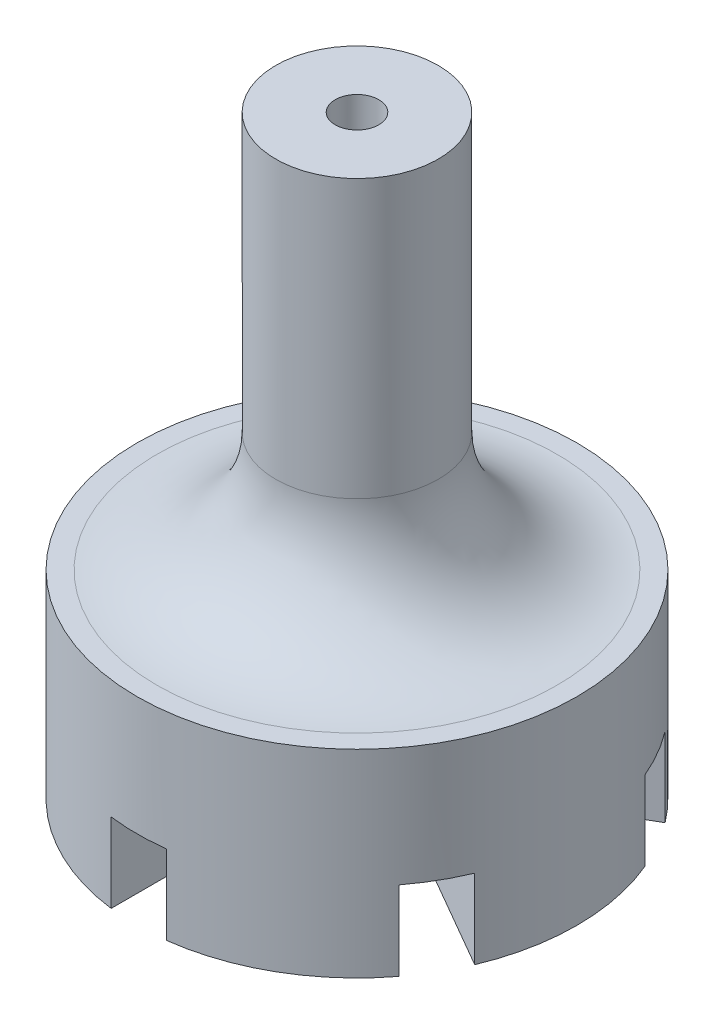
ISO-10303-21;
HEADER;
FILE_DESCRIPTION(('STEP AP214'),'2;1');
FILE_NAME('part.step','',(''),(''),'','','');
FILE_SCHEMA(('AUTOMOTIVE_DESIGN { 1 0 10303 214 1 1 1 1 }'));
ENDSEC;
DATA;
#1=APPLICATION_CONTEXT('core data for automotive mechanical design processes');
#2=APPLICATION_PROTOCOL_DEFINITION('international standard','automotive_design',2000,#1);
#3=PRODUCT_CONTEXT('',#1,'mechanical');
#4=PRODUCT('Part','Part','',(#3));
#5=PRODUCT_RELATED_PRODUCT_CATEGORY('part','',(#4));
#6=PRODUCT_DEFINITION_FORMATION('','',#4);
#7=PRODUCT_DEFINITION_CONTEXT('part definition',#1,'design');
#8=PRODUCT_DEFINITION('design','',#6,#7);
#9=PRODUCT_DEFINITION_SHAPE('','',#8);
#10=(LENGTH_UNIT() NAMED_UNIT(*) SI_UNIT(.MILLI.,.METRE.));
#11=(NAMED_UNIT(*) PLANE_ANGLE_UNIT() SI_UNIT($,.RADIAN.));
#12=(NAMED_UNIT(*) SI_UNIT($,.STERADIAN.) SOLID_ANGLE_UNIT());
#13=UNCERTAINTY_MEASURE_WITH_UNIT(LENGTH_MEASURE(1.E-05),#10,'distance_accuracy_value','');
#14=(GEOMETRIC_REPRESENTATION_CONTEXT(3) GLOBAL_UNCERTAINTY_ASSIGNED_CONTEXT((#13)) GLOBAL_UNIT_ASSIGNED_CONTEXT((#10,
#11,#12)) REPRESENTATION_CONTEXT('',''));
#15=CARTESIAN_POINT('',(0.,0.,0.));
#16=DIRECTION('',(0.,0.,1.));
#17=DIRECTION('',(1.,0.,0.));
#18=AXIS2_PLACEMENT_3D('',#15,#16,#17);
#19=CARTESIAN_POINT('',(0.,0.,0.));
#20=DIRECTION('',(0.,-1.,0.));
#21=DIRECTION('',(0.,0.,-1.));
#22=AXIS2_PLACEMENT_3D('',#19,#20,#21);
#23=CYLINDRICAL_SURFACE('',#22,0.55);
#24=CARTESIAN_POINT('',(0.,10.,0.));
#25=DIRECTION('',(0.,-1.,0.));
#26=DIRECTION('',(0.,0.,-1.));
#27=AXIS2_PLACEMENT_3D('',#24,#25,#26);
#28=CIRCLE('',#27,0.55);
#29=CARTESIAN_POINT('',(0.,10.,-0.55));
#30=VERTEX_POINT('',#29);
#31=EDGE_CURVE('E318',#30,#30,#28,.T.);
#32=ORIENTED_EDGE('',*,*,#31,.F.);
#33=EDGE_LOOP('',(#32));
#34=FACE_BOUND('',#33,.T.);
#35=CARTESIAN_POINT('',(0.,-3.,0.));
#36=DIRECTION('',(0.,-1.,0.));
#37=DIRECTION('',(0.,0.,-1.));
#38=AXIS2_PLACEMENT_3D('',#35,#36,#37);
#39=CIRCLE('',#38,0.55);
#40=CARTESIAN_POINT('',(0.,-3.,-0.55));
#41=VERTEX_POINT('',#40);
#42=EDGE_CURVE('E300',#41,#41,#39,.T.);
#43=ORIENTED_EDGE('',*,*,#42,.T.);
#44=EDGE_LOOP('',(#43));
#45=FACE_BOUND('',#44,.T.);
#46=ADVANCED_FACE('F43',(#34,#45),#23,.F.);
#47=CARTESIAN_POINT('',(5.55,-5.,0.));
#48=DIRECTION('',(0.,-1.,0.));
#49=DIRECTION('',(0.,0.,-1.));
#50=AXIS2_PLACEMENT_3D('',#47,#48,#49);
#51=PLANE('',#50);
#52=DIRECTION('',(0.,0.,1.));
#53=VECTOR('',#52,1.);
#54=CARTESIAN_POINT('',(0.7,-5.,1.21243556529821));
#55=LINE('',#54,#53);
#56=CARTESIAN_POINT('',(0.7,-5.,1.21243556529821));
#57=VERTEX_POINT('',#56);
#58=CARTESIAN_POINT('',(0.7,-5.,5.50567888638631));
#59=VERTEX_POINT('',#58);
#60=EDGE_CURVE('E179',#57,#59,#55,.T.);
#61=ORIENTED_EDGE('',*,*,#60,.F.);
#62=DIRECTION('',(-0.866025403784439,0.,-0.5));
#63=VECTOR('',#62,1.);
#64=CARTESIAN_POINT('',(3.8125,-5.,3.00943827815092));
#65=LINE('',#64,#63);
#66=CARTESIAN_POINT('',(4.41805778069016,-5.,3.35905722584226));
#67=VERTEX_POINT('',#66);
#68=EDGE_CURVE('E336',#67,#57,#65,.T.);
#69=ORIENTED_EDGE('',*,*,#68,.F.);
#70=CARTESIAN_POINT('',(0.,-5.,0.));
#71=DIRECTION('',(0.,-1.,0.));
#72=DIRECTION('',(0.,0.,-1.));
#73=AXIS2_PLACEMENT_3D('',#70,#71,#72);
#74=CIRCLE('',#73,5.55);
#75=EDGE_CURVE('E387',#67,#59,#74,.T.);
#76=ORIENTED_EDGE('',*,*,#75,.T.);
#77=EDGE_LOOP('',(#61,#69,#76));
#78=FACE_BOUND('',#77,.T.);
#79=ADVANCED_FACE('F424',(#78),#51,.T.);
#80=DIRECTION('',(0.866025403784439,0.,0.5));
#81=VECTOR('',#80,1.);
#82=CARTESIAN_POINT('',(1.4,-5.,0.));
#83=LINE('',#82,#81);
#84=CARTESIAN_POINT('',(1.4,-5.,0.));
#85=VERTEX_POINT('',#84);
#86=CARTESIAN_POINT('',(5.11805778069016,-5.,2.14662166054405));
#87=VERTEX_POINT('',#86);
#88=EDGE_CURVE('E242',#85,#87,#83,.T.);
#89=ORIENTED_EDGE('',*,*,#88,.F.);
#90=DIRECTION('',(-0.866025403784439,0.,0.5));
#91=VECTOR('',#90,1.);
#92=CARTESIAN_POINT('',(4.5125,-5.,-1.79700271285271));
#93=LINE('',#92,#91);
#94=CARTESIAN_POINT('',(5.11805778069016,-5.,-2.14662166054405));
#95=VERTEX_POINT('',#94);
#96=EDGE_CURVE('E333',#95,#85,#93,.T.);
#97=ORIENTED_EDGE('',*,*,#96,.F.);
#98=EDGE_CURVE('E391',#95,#87,#74,.T.);
#99=ORIENTED_EDGE('',*,*,#98,.T.);
#100=EDGE_LOOP('',(#89,#97,#99));
#101=FACE_BOUND('',#100,.T.);
#102=ADVANCED_FACE('F430',(#101),#51,.T.);
#103=DIRECTION('',(0.866025403784439,0.,-0.5));
#104=VECTOR('',#103,1.);
#105=CARTESIAN_POINT('',(0.7,-5.,-1.21243556529821));
#106=LINE('',#105,#104);
#107=CARTESIAN_POINT('',(0.7,-5.,-1.21243556529821));
#108=VERTEX_POINT('',#107);
#109=CARTESIAN_POINT('',(4.41805778069017,-5.,-3.35905722584226));
#110=VERTEX_POINT('',#109);
#111=EDGE_CURVE('E239',#108,#110,#106,.T.);
#112=ORIENTED_EDGE('',*,*,#111,.F.);
#113=DIRECTION('',(0.,0.,1.));
#114=VECTOR('',#113,1.);
#115=CARTESIAN_POINT('',(0.7,-5.,0.));
#116=LINE('',#115,#114);
#117=CARTESIAN_POINT('',(0.700000000000001,-5.,-5.50567888638631));
#118=VERTEX_POINT('',#117);
#119=EDGE_CURVE('E330',#118,#108,#116,.T.);
#120=ORIENTED_EDGE('',*,*,#119,.F.);
#121=EDGE_CURVE('E309',#118,#110,#74,.T.);
#122=ORIENTED_EDGE('',*,*,#121,.T.);
#123=EDGE_LOOP('',(#112,#120,#122));
#124=FACE_BOUND('',#123,.T.);
#125=ADVANCED_FACE('F501',(#124),#51,.T.);
#126=DIRECTION('',(0.,0.,-1.));
#127=VECTOR('',#126,1.);
#128=CARTESIAN_POINT('',(-0.7,-5.,-1.21243556529821));
#129=LINE('',#128,#127);
#130=CARTESIAN_POINT('',(-0.7,-5.,-1.21243556529821));
#131=VERTEX_POINT('',#130);
#132=CARTESIAN_POINT('',(-0.699999999999999,-5.,-5.50567888638631));
#133=VERTEX_POINT('',#132);
#134=EDGE_CURVE('E236',#131,#133,#129,.T.);
#135=ORIENTED_EDGE('',*,*,#134,.F.);
#136=DIRECTION('',(0.866025403784438,0.,0.500000000000001));
#137=VECTOR('',#136,1.);
#138=CARTESIAN_POINT('',(4.5125,-5.,1.79700271285271));
#139=LINE('',#138,#137);
#140=CARTESIAN_POINT('',(-4.41805778069016,-5.,-3.35905722584226));
#141=VERTEX_POINT('',#140);
#142=EDGE_CURVE('E327',#141,#131,#139,.T.);
#143=ORIENTED_EDGE('',*,*,#142,.F.);
#144=EDGE_CURVE('E304',#141,#133,#74,.T.);
#145=ORIENTED_EDGE('',*,*,#144,.T.);
#146=EDGE_LOOP('',(#135,#143,#145));
#147=FACE_BOUND('',#146,.T.);
#148=ADVANCED_FACE('F491',(#147),#51,.T.);
#149=DIRECTION('',(-0.866025403784438,0.,-0.5));
#150=VECTOR('',#149,1.);
#151=CARTESIAN_POINT('',(-1.4,-5.,0.));
#152=LINE('',#151,#150);
#153=CARTESIAN_POINT('',(-1.4,-5.,0.));
#154=VERTEX_POINT('',#153);
#155=CARTESIAN_POINT('',(-5.11805778069016,-5.,-2.14662166054405));
#156=VERTEX_POINT('',#155);
#157=EDGE_CURVE('E233',#154,#156,#152,.T.);
#158=ORIENTED_EDGE('',*,*,#157,.F.);
#159=DIRECTION('',(0.866025403784439,0.,-0.499999999999999));
#160=VECTOR('',#159,1.);
#161=CARTESIAN_POINT('',(3.81250000000001,-5.,-3.00943827815092));
#162=LINE('',#161,#160);
#163=CARTESIAN_POINT('',(-5.11805778069017,-5.,2.14662166054404));
#164=VERTEX_POINT('',#163);
#165=EDGE_CURVE('E324',#164,#154,#162,.T.);
#166=ORIENTED_EDGE('',*,*,#165,.F.);
#167=EDGE_CURVE('E308',#164,#156,#74,.T.);
#168=ORIENTED_EDGE('',*,*,#167,.T.);
#169=EDGE_LOOP('',(#158,#166,#168));
#170=FACE_BOUND('',#169,.T.);
#171=ADVANCED_FACE('F405',(#170),#51,.T.);
#172=CARTESIAN_POINT('',(0.55,10.,0.));
#173=DIRECTION('',(0.,1.,0.));
#174=DIRECTION('',(0.,0.,1.));
#175=AXIS2_PLACEMENT_3D('',#172,#173,#174);
#176=PLANE('',#175);
#177=ORIENTED_EDGE('',*,*,#31,.T.);
#178=EDGE_LOOP('',(#177));
#179=FACE_BOUND('',#178,.T.);
#180=CARTESIAN_POINT('',(0.,10.,0.));
#181=DIRECTION('',(0.,-1.,0.));
#182=DIRECTION('',(0.,0.,-1.));
#183=AXIS2_PLACEMENT_3D('',#180,#181,#182);
#184=CIRCLE('',#183,2.05);
#185=CARTESIAN_POINT('',(0.,10.,-2.05));
#186=VERTEX_POINT('',#185);
#187=EDGE_CURVE('E314',#186,#186,#184,.T.);
#188=ORIENTED_EDGE('',*,*,#187,.F.);
#189=EDGE_LOOP('',(#188));
#190=FACE_BOUND('',#189,.T.);
#191=ADVANCED_FACE('F436',(#179,#190),#176,.T.);
#192=CARTESIAN_POINT('',(0.,0.,0.));
#193=DIRECTION('',(0.,-1.,0.));
#194=DIRECTION('',(0.,0.,-1.));
#195=AXIS2_PLACEMENT_3D('',#192,#193,#194);
#196=CYLINDRICAL_SURFACE('',#195,2.05);
#197=CARTESIAN_POINT('',(0.,3.,0.));
#198=DIRECTION('',(0.,1.,0.));
#199=DIRECTION('',(0.,0.,1.));
#200=AXIS2_PLACEMENT_3D('',#197,#198,#199);
#201=CIRCLE('',#200,2.05);
#202=CARTESIAN_POINT('',(0.,3.,2.05));
#203=VERTEX_POINT('',#202);
#204=EDGE_CURVE('E11',#203,#203,#201,.T.);
#205=ORIENTED_EDGE('',*,*,#204,.T.);
#206=EDGE_LOOP('',(#205));
#207=FACE_BOUND('',#206,.T.);
#208=ORIENTED_EDGE('',*,*,#187,.T.);
#209=EDGE_LOOP('',(#208));
#210=FACE_BOUND('',#209,.T.);
#211=ADVANCED_FACE('F438',(#207,#210),#196,.T.);
#212=CARTESIAN_POINT('',(2.05,0.,0.));
#213=DIRECTION('',(0.,1.,0.));
#214=DIRECTION('',(0.,0.,1.));
#215=AXIS2_PLACEMENT_3D('',#212,#213,#214);
#216=PLANE('',#215);
#217=CARTESIAN_POINT('',(0.,0.,0.));
#218=DIRECTION('',(0.,1.,0.));
#219=DIRECTION('',(0.,0.,1.));
#220=AXIS2_PLACEMENT_3D('',#217,#218,#219);
#221=CIRCLE('',#220,5.05);
#222=CARTESIAN_POINT('',(0.,0.,5.05));
#223=VERTEX_POINT('',#222);
#224=EDGE_CURVE('E52',#223,#223,#221,.F.);
#225=ORIENTED_EDGE('',*,*,#224,.T.);
#226=EDGE_LOOP('',(#225));
#227=FACE_BOUND('',#226,.T.);
#228=CARTESIAN_POINT('',(0.,0.,0.));
#229=DIRECTION('',(0.,-1.,0.));
#230=DIRECTION('',(0.,0.,-1.));
#231=AXIS2_PLACEMENT_3D('',#228,#229,#230);
#232=CIRCLE('',#231,5.55);
#233=CARTESIAN_POINT('',(0.,0.,-5.55));
#234=VERTEX_POINT('',#233);
#235=EDGE_CURVE('E310',#234,#234,#232,.T.);
#236=ORIENTED_EDGE('',*,*,#235,.F.);
#237=EDGE_LOOP('',(#236));
#238=FACE_BOUND('',#237,.T.);
#239=ADVANCED_FACE('F442',(#227,#238),#216,.T.);
#240=CARTESIAN_POINT('',(0.,0.,0.));
#241=DIRECTION('',(0.,-1.,0.));
#242=DIRECTION('',(0.,0.,-1.));
#243=AXIS2_PLACEMENT_3D('',#240,#241,#242);
#244=CYLINDRICAL_SURFACE('',#243,5.55);
#245=DIRECTION('',(0.,-1.,0.));
#246=VECTOR('',#245,1.);
#247=CARTESIAN_POINT('',(-4.41805778069016,0.,-3.35905722584226));
#248=LINE('',#247,#246);
#249=CARTESIAN_POINT('',(-4.41805778069016,-3.,-3.35905722584226));
#250=VERTEX_POINT('',#249);
#251=EDGE_CURVE('E276',#250,#141,#248,.T.);
#252=ORIENTED_EDGE('',*,*,#251,.F.);
#253=CARTESIAN_POINT('',(0.,-3.,0.));
#254=DIRECTION('',(0.,-1.,0.));
#255=DIRECTION('',(0.,0.,-1.));
#256=AXIS2_PLACEMENT_3D('',#253,#254,#255);
#257=CIRCLE('',#256,5.55);
#258=CARTESIAN_POINT('',(-5.11805778069016,-3.,-2.14662166054405));
#259=VERTEX_POINT('',#258);
#260=EDGE_CURVE('E342',#250,#259,#257,.F.);
#261=ORIENTED_EDGE('',*,*,#260,.T.);
#262=DIRECTION('',(0.,-1.,0.));
#263=VECTOR('',#262,1.);
#264=CARTESIAN_POINT('',(-5.11805778069016,0.,-2.14662166054405));
#265=LINE('',#264,#263);
#266=EDGE_CURVE('E273',#156,#259,#265,.F.);
#267=ORIENTED_EDGE('',*,*,#266,.F.);
#268=ORIENTED_EDGE('',*,*,#167,.F.);
#269=DIRECTION('',(0.,-1.,0.));
#270=VECTOR('',#269,1.);
#271=CARTESIAN_POINT('',(-5.11805778069016,0.,2.14662166054404));
#272=LINE('',#271,#270);
#273=CARTESIAN_POINT('',(-5.11805778069016,-3.,2.14662166054404));
#274=VERTEX_POINT('',#273);
#275=EDGE_CURVE('E270',#274,#164,#272,.T.);
#276=ORIENTED_EDGE('',*,*,#275,.F.);
#277=CARTESIAN_POINT('',(-4.41805778069016,-3.,3.35905722584226));
#278=VERTEX_POINT('',#277);
#279=EDGE_CURVE('E349',#274,#278,#257,.F.);
#280=ORIENTED_EDGE('',*,*,#279,.T.);
#281=DIRECTION('',(0.,-1.,0.));
#282=VECTOR('',#281,1.);
#283=CARTESIAN_POINT('',(-4.41805778069017,0.,3.35905722584226));
#284=LINE('',#283,#282);
#285=CARTESIAN_POINT('',(-4.41805778069017,-5.,3.35905722584226));
#286=VERTEX_POINT('',#285);
#287=EDGE_CURVE('E193',#286,#278,#284,.F.);
#288=ORIENTED_EDGE('',*,*,#287,.F.);
#289=CARTESIAN_POINT('',(-0.7,-5.,5.50567888638631));
#290=VERTEX_POINT('',#289);
#291=EDGE_CURVE('E392',#290,#286,#74,.T.);
#292=ORIENTED_EDGE('',*,*,#291,.F.);
#293=DIRECTION('',(0.,-1.,0.));
#294=VECTOR('',#293,1.);
#295=CARTESIAN_POINT('',(-0.7,0.,5.50567888638631));
#296=LINE('',#295,#294);
#297=CARTESIAN_POINT('',(-0.7,-3.,5.50567888638631));
#298=VERTEX_POINT('',#297);
#299=EDGE_CURVE('E59',#298,#290,#296,.T.);
#300=ORIENTED_EDGE('',*,*,#299,.F.);
#301=CARTESIAN_POINT('',(0.7,-3.,5.50567888638631));
#302=VERTEX_POINT('',#301);
#303=EDGE_CURVE('E177',#298,#302,#257,.F.);
#304=ORIENTED_EDGE('',*,*,#303,.T.);
#305=DIRECTION('',(0.,-1.,0.));
#306=VECTOR('',#305,1.);
#307=CARTESIAN_POINT('',(0.7,0.,5.50567888638631));
#308=LINE('',#307,#306);
#309=EDGE_CURVE('E67',#59,#302,#308,.F.);
#310=ORIENTED_EDGE('',*,*,#309,.F.);
#311=ORIENTED_EDGE('',*,*,#75,.F.);
#312=DIRECTION('',(0.,-1.,0.));
#313=VECTOR('',#312,1.);
#314=CARTESIAN_POINT('',(4.41805778069016,0.,3.35905722584226));
#315=LINE('',#314,#313);
#316=CARTESIAN_POINT('',(4.41805778069016,-3.,3.35905722584226));
#317=VERTEX_POINT('',#316);
#318=EDGE_CURVE('E295',#317,#67,#315,.T.);
#319=ORIENTED_EDGE('',*,*,#318,.F.);
#320=CARTESIAN_POINT('',(5.11805778069016,-3.,2.14662166054405));
#321=VERTEX_POINT('',#320);
#322=EDGE_CURVE('E356',#317,#321,#257,.F.);
#323=ORIENTED_EDGE('',*,*,#322,.T.);
#324=DIRECTION('',(0.,-1.,0.));
#325=VECTOR('',#324,1.);
#326=CARTESIAN_POINT('',(5.11805778069016,0.,2.14662166054405));
#327=LINE('',#326,#325);
#328=EDGE_CURVE('E292',#87,#321,#327,.F.);
#329=ORIENTED_EDGE('',*,*,#328,.F.);
#330=ORIENTED_EDGE('',*,*,#98,.F.);
#331=DIRECTION('',(0.,-1.,0.));
#332=VECTOR('',#331,1.);
#333=CARTESIAN_POINT('',(5.11805778069016,0.,-2.14662166054405));
#334=LINE('',#333,#332);
#335=CARTESIAN_POINT('',(5.11805778069016,-3.,-2.14662166054405));
#336=VERTEX_POINT('',#335);
#337=EDGE_CURVE('E289',#336,#95,#334,.T.);
#338=ORIENTED_EDGE('',*,*,#337,.F.);
#339=CARTESIAN_POINT('',(4.41805778069016,-3.,-3.35905722584226));
#340=VERTEX_POINT('',#339);
#341=EDGE_CURVE('E341',#336,#340,#257,.F.);
#342=ORIENTED_EDGE('',*,*,#341,.T.);
#343=DIRECTION('',(0.,-1.,0.));
#344=VECTOR('',#343,1.);
#345=CARTESIAN_POINT('',(4.41805778069016,0.,-3.35905722584226));
#346=LINE('',#345,#344);
#347=EDGE_CURVE('E286',#110,#340,#346,.F.);
#348=ORIENTED_EDGE('',*,*,#347,.F.);
#349=ORIENTED_EDGE('',*,*,#121,.F.);
#350=DIRECTION('',(0.,-1.,0.));
#351=VECTOR('',#350,1.);
#352=CARTESIAN_POINT('',(0.700000000000001,0.,-5.50567888638631));
#353=LINE('',#352,#351);
#354=CARTESIAN_POINT('',(0.700000000000001,-3.,-5.50567888638631));
#355=VERTEX_POINT('',#354);
#356=EDGE_CURVE('E283',#355,#118,#353,.T.);
#357=ORIENTED_EDGE('',*,*,#356,.F.);
#358=CARTESIAN_POINT('',(-0.699999999999999,-3.,-5.50567888638631));
#359=VERTEX_POINT('',#358);
#360=EDGE_CURVE('E339',#355,#359,#257,.F.);
#361=ORIENTED_EDGE('',*,*,#360,.T.);
#362=DIRECTION('',(0.,-1.,0.));
#363=VECTOR('',#362,1.);
#364=CARTESIAN_POINT('',(-0.699999999999999,0.,-5.50567888638631));
#365=LINE('',#364,#363);
#366=EDGE_CURVE('E279',#133,#359,#365,.F.);
#367=ORIENTED_EDGE('',*,*,#366,.F.);
#368=ORIENTED_EDGE('',*,*,#144,.F.);
#369=EDGE_LOOP('',(#252,#261,#267,#268,#276,#280,#288,#292,#300,#304,#310,#311,#319,#323,#329,
#330,#338,#342,#348,#349,#357,#361,#367,#368));
#370=FACE_BOUND('',#369,.T.);
#371=ORIENTED_EDGE('',*,*,#235,.T.);
#372=EDGE_LOOP('',(#371));
#373=FACE_BOUND('',#372,.T.);
#374=ADVANCED_FACE('F365',(#370,#373),#244,.T.);
#375=DIRECTION('',(-0.866025403784439,0.,0.499999999999999));
#376=VECTOR('',#375,1.);
#377=CARTESIAN_POINT('',(-0.699999999999999,-5.,1.21243556529821));
#378=LINE('',#377,#376);
#379=CARTESIAN_POINT('',(-0.699999999999999,-5.,1.21243556529821));
#380=VERTEX_POINT('',#379);
#381=EDGE_CURVE('E230',#380,#286,#378,.T.);
#382=ORIENTED_EDGE('',*,*,#381,.F.);
#383=DIRECTION('',(0.,0.,-1.));
#384=VECTOR('',#383,1.);
#385=CARTESIAN_POINT('',(-0.699999999999999,-5.,0.));
#386=LINE('',#385,#384);
#387=EDGE_CURVE('E184',#290,#380,#386,.T.);
#388=ORIENTED_EDGE('',*,*,#387,.F.);
#389=ORIENTED_EDGE('',*,*,#291,.T.);
#390=EDGE_LOOP('',(#382,#388,#389));
#391=FACE_BOUND('',#390,.T.);
#392=ADVANCED_FACE('F432',(#391),#51,.T.);
#393=CARTESIAN_POINT('',(0.7,-3.,1.21243556529821));
#394=DIRECTION('',(1.,0.,0.));
#395=DIRECTION('',(0.,0.,-1.));
#396=AXIS2_PLACEMENT_3D('',#393,#394,#395);
#397=PLANE('',#396);
#398=ORIENTED_EDGE('',*,*,#309,.T.);
#399=DIRECTION('',(0.,0.,1.));
#400=VECTOR('',#399,1.);
#401=CARTESIAN_POINT('',(0.7,-3.,1.21243556529821));
#402=LINE('',#401,#400);
#403=CARTESIAN_POINT('',(0.7,-3.,1.21243556529821));
#404=VERTEX_POINT('',#403);
#405=EDGE_CURVE('E189',#404,#302,#402,.T.);
#406=ORIENTED_EDGE('',*,*,#405,.F.);
#407=DIRECTION('',(0.,-1.,0.));
#408=VECTOR('',#407,1.);
#409=CARTESIAN_POINT('',(0.7,-3.,1.21243556529821));
#410=LINE('',#409,#408);
#411=EDGE_CURVE('E247',#404,#57,#410,.T.);
#412=ORIENTED_EDGE('',*,*,#411,.T.);
#413=ORIENTED_EDGE('',*,*,#60,.T.);
#414=EDGE_LOOP('',(#398,#406,#412,#413));
#415=FACE_BOUND('',#414,.T.);
#416=ADVANCED_FACE('F449',(#415),#397,.F.);
#417=CARTESIAN_POINT('',(4.45644099100364,-3.,3.38121778264911));
#418=DIRECTION('',(-0.5,0.,0.866025403784439));
#419=DIRECTION('',(0.866025403784439,0.,0.5));
#420=AXIS2_PLACEMENT_3D('',#417,#418,#419);
#421=PLANE('',#420);
#422=ORIENTED_EDGE('',*,*,#318,.T.);
#423=ORIENTED_EDGE('',*,*,#68,.T.);
#424=ORIENTED_EDGE('',*,*,#411,.F.);
#425=DIRECTION('',(-0.866025403784439,0.,-0.5));
#426=VECTOR('',#425,1.);
#427=CARTESIAN_POINT('',(4.45644099100364,-3.,3.38121778264911));
#428=LINE('',#427,#426);
#429=EDGE_CURVE('E225',#317,#404,#428,.T.);
#430=ORIENTED_EDGE('',*,*,#429,.F.);
#431=EDGE_LOOP('',(#422,#423,#424,#430));
#432=FACE_BOUND('',#431,.T.);
#433=ADVANCED_FACE('F383',(#432),#421,.F.);
#434=CARTESIAN_POINT('',(1.4,-3.,0.));
#435=DIRECTION('',(0.5,0.,-0.866025403784439));
#436=DIRECTION('',(-0.866025403784439,0.,-0.5));
#437=AXIS2_PLACEMENT_3D('',#434,#435,#436);
#438=PLANE('',#437);
#439=ORIENTED_EDGE('',*,*,#328,.T.);
#440=DIRECTION('',(0.866025403784439,0.,0.5));
#441=VECTOR('',#440,1.);
#442=CARTESIAN_POINT('',(1.4,-3.,0.));
#443=LINE('',#442,#441);
#444=CARTESIAN_POINT('',(1.4,-3.,0.));
#445=VERTEX_POINT('',#444);
#446=EDGE_CURVE('E221',#445,#321,#443,.T.);
#447=ORIENTED_EDGE('',*,*,#446,.F.);
#448=DIRECTION('',(0.,-1.,0.));
#449=VECTOR('',#448,1.);
#450=CARTESIAN_POINT('',(1.4,-3.,0.));
#451=LINE('',#450,#449);
#452=EDGE_CURVE('E251',#445,#85,#451,.T.);
#453=ORIENTED_EDGE('',*,*,#452,.T.);
#454=ORIENTED_EDGE('',*,*,#88,.T.);
#455=EDGE_LOOP('',(#439,#447,#453,#454));
#456=FACE_BOUND('',#455,.T.);
#457=ADVANCED_FACE('F379',(#456),#438,.F.);
#458=CARTESIAN_POINT('',(5.15644099100363,-3.,-2.16878221735089));
#459=DIRECTION('',(0.5,0.,0.866025403784439));
#460=DIRECTION('',(0.866025403784439,0.,-0.5));
#461=AXIS2_PLACEMENT_3D('',#458,#459,#460);
#462=PLANE('',#461);
#463=ORIENTED_EDGE('',*,*,#337,.T.);
#464=ORIENTED_EDGE('',*,*,#96,.T.);
#465=ORIENTED_EDGE('',*,*,#452,.F.);
#466=DIRECTION('',(-0.866025403784439,0.,0.5));
#467=VECTOR('',#466,1.);
#468=CARTESIAN_POINT('',(5.15644099100363,-3.,-2.16878221735089));
#469=LINE('',#468,#467);
#470=EDGE_CURVE('E218',#336,#445,#469,.T.);
#471=ORIENTED_EDGE('',*,*,#470,.F.);
#472=EDGE_LOOP('',(#463,#464,#465,#471));
#473=FACE_BOUND('',#472,.T.);
#474=ADVANCED_FACE('F374',(#473),#462,.F.);
#475=CARTESIAN_POINT('',(0.7,-3.,-1.21243556529821));
#476=DIRECTION('',(-0.5,0.,-0.866025403784439));
#477=DIRECTION('',(-0.866025403784439,0.,0.5));
#478=AXIS2_PLACEMENT_3D('',#475,#476,#477);
#479=PLANE('',#478);
#480=ORIENTED_EDGE('',*,*,#347,.T.);
#481=DIRECTION('',(0.866025403784439,0.,-0.5));
#482=VECTOR('',#481,1.);
#483=CARTESIAN_POINT('',(0.7,-3.,-1.21243556529821));
#484=LINE('',#483,#482);
#485=CARTESIAN_POINT('',(0.7,-3.,-1.21243556529821));
#486=VERTEX_POINT('',#485);
#487=EDGE_CURVE('E214',#486,#340,#484,.T.);
#488=ORIENTED_EDGE('',*,*,#487,.F.);
#489=DIRECTION('',(0.,-1.,0.));
#490=VECTOR('',#489,1.);
#491=CARTESIAN_POINT('',(0.7,-3.,-1.21243556529821));
#492=LINE('',#491,#490);
#493=EDGE_CURVE('E255',#486,#108,#492,.T.);
#494=ORIENTED_EDGE('',*,*,#493,.T.);
#495=ORIENTED_EDGE('',*,*,#111,.T.);
#496=EDGE_LOOP('',(#480,#488,#494,#495));
#497=FACE_BOUND('',#496,.T.);
#498=ADVANCED_FACE('F470',(#497),#479,.F.);
#499=CARTESIAN_POINT('',(0.700000000000001,-3.,-5.55));
#500=DIRECTION('',(1.,0.,0.));
#501=DIRECTION('',(0.,0.,-1.));
#502=AXIS2_PLACEMENT_3D('',#499,#500,#501);
#503=PLANE('',#502);
#504=ORIENTED_EDGE('',*,*,#356,.T.);
#505=ORIENTED_EDGE('',*,*,#119,.T.);
#506=ORIENTED_EDGE('',*,*,#493,.F.);
#507=DIRECTION('',(0.,0.,1.));
#508=VECTOR('',#507,1.);
#509=CARTESIAN_POINT('',(0.700000000000001,-3.,-5.55));
#510=LINE('',#509,#508);
#511=EDGE_CURVE('E211',#355,#486,#510,.T.);
#512=ORIENTED_EDGE('',*,*,#511,.F.);
#513=EDGE_LOOP('',(#504,#505,#506,#512));
#514=FACE_BOUND('',#513,.T.);
#515=ADVANCED_FACE('F473',(#514),#503,.F.);
#516=CARTESIAN_POINT('',(-0.7,-3.,-1.21243556529821));
#517=DIRECTION('',(-1.,0.,0.));
#518=DIRECTION('',(0.,0.,1.));
#519=AXIS2_PLACEMENT_3D('',#516,#517,#518);
#520=PLANE('',#519);
#521=ORIENTED_EDGE('',*,*,#366,.T.);
#522=DIRECTION('',(0.,0.,-1.));
#523=VECTOR('',#522,1.);
#524=CARTESIAN_POINT('',(-0.7,-3.,-1.21243556529821));
#525=LINE('',#524,#523);
#526=CARTESIAN_POINT('',(-0.7,-3.,-1.21243556529821));
#527=VERTEX_POINT('',#526);
#528=EDGE_CURVE('E207',#527,#359,#525,.T.);
#529=ORIENTED_EDGE('',*,*,#528,.F.);
#530=DIRECTION('',(0.,-1.,0.));
#531=VECTOR('',#530,1.);
#532=CARTESIAN_POINT('',(-0.7,-3.,-1.21243556529821));
#533=LINE('',#532,#531);
#534=EDGE_CURVE('E259',#527,#131,#533,.T.);
#535=ORIENTED_EDGE('',*,*,#534,.T.);
#536=ORIENTED_EDGE('',*,*,#134,.T.);
#537=EDGE_LOOP('',(#521,#529,#535,#536));
#538=FACE_BOUND('',#537,.T.);
#539=ADVANCED_FACE('F477',(#538),#520,.F.);
#540=CARTESIAN_POINT('',(-4.45644099100363,-3.,-3.38121778264911));
#541=DIRECTION('',(0.500000000000001,0.,-0.866025403784438));
#542=DIRECTION('',(-0.866025403784438,0.,-0.500000000000001));
#543=AXIS2_PLACEMENT_3D('',#540,#541,#542);
#544=PLANE('',#543);
#545=ORIENTED_EDGE('',*,*,#251,.T.);
#546=ORIENTED_EDGE('',*,*,#142,.T.);
#547=ORIENTED_EDGE('',*,*,#534,.F.);
#548=DIRECTION('',(0.866025403784438,0.,0.500000000000001));
#549=VECTOR('',#548,1.);
#550=CARTESIAN_POINT('',(-4.45644099100363,-3.,-3.38121778264911));
#551=LINE('',#550,#549);
#552=EDGE_CURVE('E204',#250,#527,#551,.T.);
#553=ORIENTED_EDGE('',*,*,#552,.F.);
#554=EDGE_LOOP('',(#545,#546,#547,#553));
#555=FACE_BOUND('',#554,.T.);
#556=ADVANCED_FACE('F421',(#555),#544,.F.);
#557=CARTESIAN_POINT('',(-1.4,-3.,0.));
#558=DIRECTION('',(-0.5,0.,0.866025403784438));
#559=DIRECTION('',(0.866025403784438,0.,0.5));
#560=AXIS2_PLACEMENT_3D('',#557,#558,#559);
#561=PLANE('',#560);
#562=ORIENTED_EDGE('',*,*,#266,.T.);
#563=DIRECTION('',(-0.866025403784438,0.,-0.5));
#564=VECTOR('',#563,1.);
#565=CARTESIAN_POINT('',(-1.4,-3.,0.));
#566=LINE('',#565,#564);
#567=CARTESIAN_POINT('',(-1.4,-3.,0.));
#568=VERTEX_POINT('',#567);
#569=EDGE_CURVE('E198',#568,#259,#566,.T.);
#570=ORIENTED_EDGE('',*,*,#569,.F.);
#571=DIRECTION('',(0.,-1.,0.));
#572=VECTOR('',#571,1.);
#573=CARTESIAN_POINT('',(-1.4,-3.,0.));
#574=LINE('',#573,#572);
#575=EDGE_CURVE('E188',#568,#154,#574,.T.);
#576=ORIENTED_EDGE('',*,*,#575,.T.);
#577=ORIENTED_EDGE('',*,*,#157,.T.);
#578=EDGE_LOOP('',(#562,#570,#576,#577));
#579=FACE_BOUND('',#578,.T.);
#580=ADVANCED_FACE('F408',(#579),#561,.F.);
#581=CARTESIAN_POINT('',(-5.15644099100364,-3.,2.16878221735089));
#582=DIRECTION('',(-0.499999999999999,0.,-0.866025403784439));
#583=DIRECTION('',(-0.866025403784439,0.,0.499999999999999));
#584=AXIS2_PLACEMENT_3D('',#581,#582,#583);
#585=PLANE('',#584);
#586=ORIENTED_EDGE('',*,*,#275,.T.);
#587=ORIENTED_EDGE('',*,*,#165,.T.);
#588=ORIENTED_EDGE('',*,*,#575,.F.);
#589=DIRECTION('',(0.866025403784439,0.,-0.499999999999999));
#590=VECTOR('',#589,1.);
#591=CARTESIAN_POINT('',(-5.15644099100364,-3.,2.16878221735089));
#592=LINE('',#591,#590);
#593=EDGE_CURVE('E195',#274,#568,#592,.T.);
#594=ORIENTED_EDGE('',*,*,#593,.F.);
#595=EDGE_LOOP('',(#586,#587,#588,#594));
#596=FACE_BOUND('',#595,.T.);
#597=ADVANCED_FACE('F413',(#596),#585,.F.);
#598=CARTESIAN_POINT('',(-0.699999999999999,-3.,1.21243556529821));
#599=DIRECTION('',(0.5,0.,0.866025403784439));
#600=DIRECTION('',(0.866025403784439,0.,-0.499999999999999));
#601=AXIS2_PLACEMENT_3D('',#598,#599,#600);
#602=PLANE('',#601);
#603=ORIENTED_EDGE('',*,*,#287,.T.);
#604=DIRECTION('',(-0.866025403784439,0.,0.499999999999999));
#605=VECTOR('',#604,1.);
#606=CARTESIAN_POINT('',(-0.699999999999999,-3.,1.21243556529821));
#607=LINE('',#606,#605);
#608=CARTESIAN_POINT('',(-0.699999999999999,-3.,1.21243556529821));
#609=VERTEX_POINT('',#608);
#610=EDGE_CURVE('E174',#609,#278,#607,.T.);
#611=ORIENTED_EDGE('',*,*,#610,.F.);
#612=DIRECTION('',(0.,-1.,0.));
#613=VECTOR('',#612,1.);
#614=CARTESIAN_POINT('',(-0.699999999999999,-3.,1.21243556529821));
#615=LINE('',#614,#613);
#616=EDGE_CURVE('E182',#609,#380,#615,.T.);
#617=ORIENTED_EDGE('',*,*,#616,.T.);
#618=ORIENTED_EDGE('',*,*,#381,.T.);
#619=EDGE_LOOP('',(#603,#611,#617,#618));
#620=FACE_BOUND('',#619,.T.);
#621=ADVANCED_FACE('F191',(#620),#602,.F.);
#622=CARTESIAN_POINT('',(-0.7,-3.,5.55));
#623=DIRECTION('',(-1.,0.,0.));
#624=DIRECTION('',(0.,0.,1.));
#625=AXIS2_PLACEMENT_3D('',#622,#623,#624);
#626=PLANE('',#625);
#627=ORIENTED_EDGE('',*,*,#299,.T.);
#628=ORIENTED_EDGE('',*,*,#387,.T.);
#629=ORIENTED_EDGE('',*,*,#616,.F.);
#630=DIRECTION('',(0.,0.,-1.));
#631=VECTOR('',#630,1.);
#632=CARTESIAN_POINT('',(-0.7,-3.,5.55));
#633=LINE('',#632,#631);
#634=EDGE_CURVE('E170',#298,#609,#633,.T.);
#635=ORIENTED_EDGE('',*,*,#634,.F.);
#636=EDGE_LOOP('',(#627,#628,#629,#635));
#637=FACE_BOUND('',#636,.T.);
#638=ADVANCED_FACE('F183',(#637),#626,.F.);
#639=CARTESIAN_POINT('',(0.,-3.,0.));
#640=DIRECTION('',(0.,-1.,0.));
#641=DIRECTION('',(0.,0.,-1.));
#642=AXIS2_PLACEMENT_3D('',#639,#640,#641);
#643=PLANE('',#642);
#644=ORIENTED_EDGE('',*,*,#42,.F.);
#645=EDGE_LOOP('',(#644));
#646=FACE_BOUND('',#645,.T.);
#647=ORIENTED_EDGE('',*,*,#552,.T.);
#648=ORIENTED_EDGE('',*,*,#528,.T.);
#649=ORIENTED_EDGE('',*,*,#360,.F.);
#650=ORIENTED_EDGE('',*,*,#511,.T.);
#651=ORIENTED_EDGE('',*,*,#487,.T.);
#652=ORIENTED_EDGE('',*,*,#341,.F.);
#653=ORIENTED_EDGE('',*,*,#470,.T.);
#654=ORIENTED_EDGE('',*,*,#446,.T.);
#655=ORIENTED_EDGE('',*,*,#322,.F.);
#656=ORIENTED_EDGE('',*,*,#429,.T.);
#657=ORIENTED_EDGE('',*,*,#405,.T.);
#658=ORIENTED_EDGE('',*,*,#303,.F.);
#659=ORIENTED_EDGE('',*,*,#634,.T.);
#660=ORIENTED_EDGE('',*,*,#610,.T.);
#661=ORIENTED_EDGE('',*,*,#279,.F.);
#662=ORIENTED_EDGE('',*,*,#593,.T.);
#663=ORIENTED_EDGE('',*,*,#569,.T.);
#664=ORIENTED_EDGE('',*,*,#260,.F.);
#665=EDGE_LOOP('',(#647,#648,#649,#650,#651,#652,#653,#654,#655,#656,#657,#658,#659,#660,#661,
#662,#663,#664));
#666=FACE_BOUND('',#665,.T.);
#667=ADVANCED_FACE('F172',(#646,#666),#643,.T.);
#668=CARTESIAN_POINT('',(0.,3.,0.));
#669=DIRECTION('',(0.,1.,0.));
#670=DIRECTION('',(0.,0.,1.));
#671=AXIS2_PLACEMENT_3D('',#668,#669,#670);
#672=TOROIDAL_SURFACE('',#671,5.05,3.);
#673=ORIENTED_EDGE('',*,*,#204,.F.);
#674=EDGE_LOOP('',(#673));
#675=FACE_BOUND('',#674,.T.);
#676=ORIENTED_EDGE('',*,*,#224,.F.);
#677=EDGE_LOOP('',(#676));
#678=FACE_BOUND('',#677,.T.);
#679=ADVANCED_FACE('F45',(#675,#678),#672,.F.);
#680=CLOSED_SHELL('',(#46,#79,#102,#125,#148,#171,#191,#211,#239,#374,#392,#416,#433,#457,#474,
#498,#515,#539,#556,#580,#597,#621,#638,#667,#679));
#681=MANIFOLD_SOLID_BREP('B2',#680);
#682=ADVANCED_BREP_SHAPE_REPRESENTATION('',(#18,#681),#14);
#683=SHAPE_DEFINITION_REPRESENTATION(#9,#682);
ENDSEC;
END-ISO-10303-21;
